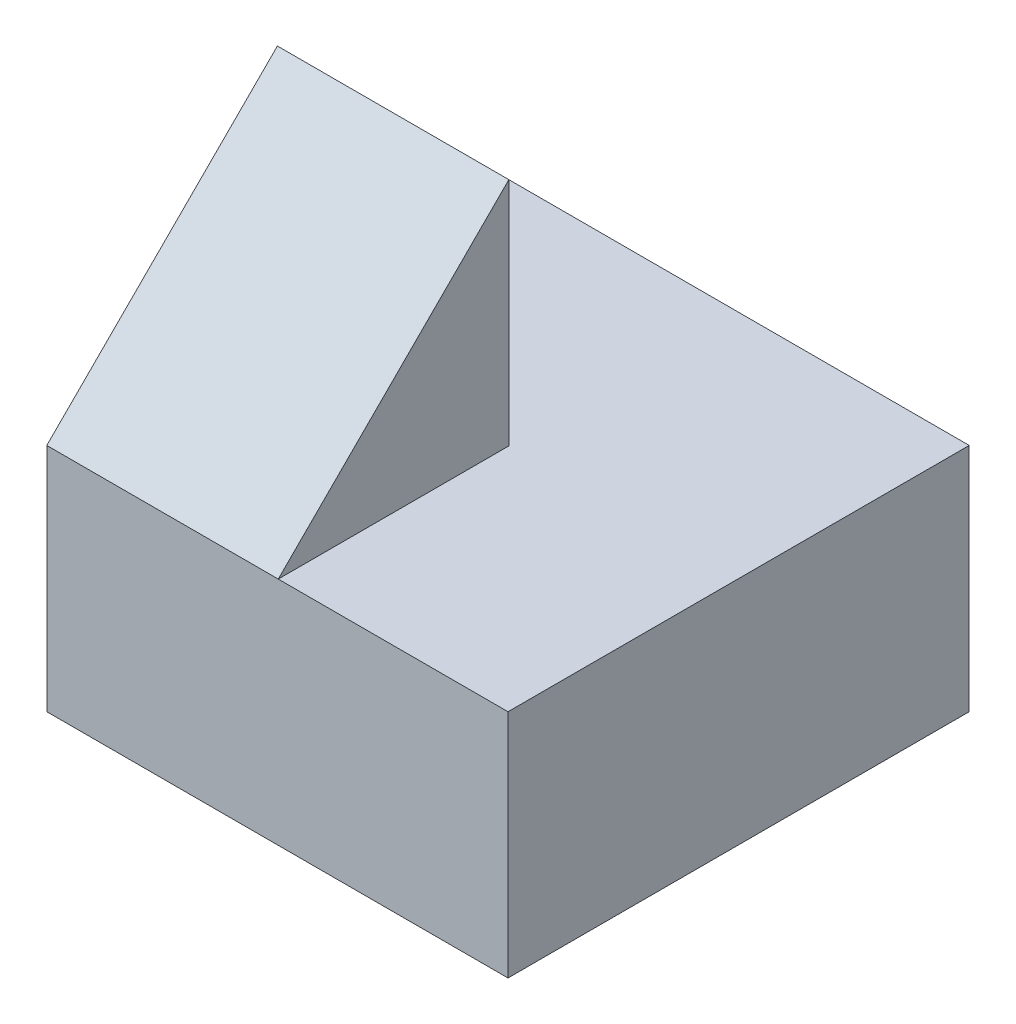
ISO-10303-21;
HEADER;
FILE_DESCRIPTION(('STEP AP214'),'2;1');
FILE_NAME('part.step','',(''),(''),'','','');
FILE_SCHEMA(('AUTOMOTIVE_DESIGN { 1 0 10303 214 1 1 1 1 }'));
ENDSEC;
DATA;
#1=APPLICATION_CONTEXT('core data for automotive mechanical design processes');
#2=APPLICATION_PROTOCOL_DEFINITION('international standard','automotive_design',2000,#1);
#3=PRODUCT_CONTEXT('',#1,'mechanical');
#4=PRODUCT('Part','Part','',(#3));
#5=PRODUCT_RELATED_PRODUCT_CATEGORY('part','',(#4));
#6=PRODUCT_DEFINITION_FORMATION('','',#4);
#7=PRODUCT_DEFINITION_CONTEXT('part definition',#1,'design');
#8=PRODUCT_DEFINITION('design','',#6,#7);
#9=PRODUCT_DEFINITION_SHAPE('','',#8);
#10=(LENGTH_UNIT() NAMED_UNIT(*) SI_UNIT(.MILLI.,.METRE.));
#11=(NAMED_UNIT(*) PLANE_ANGLE_UNIT() SI_UNIT($,.RADIAN.));
#12=(NAMED_UNIT(*) SI_UNIT($,.STERADIAN.) SOLID_ANGLE_UNIT());
#13=UNCERTAINTY_MEASURE_WITH_UNIT(LENGTH_MEASURE(1.E-05),#10,'distance_accuracy_value','');
#14=(GEOMETRIC_REPRESENTATION_CONTEXT(3) GLOBAL_UNCERTAINTY_ASSIGNED_CONTEXT((#13)) GLOBAL_UNIT_ASSIGNED_CONTEXT((#10,
#11,#12)) REPRESENTATION_CONTEXT('',''));
#15=CARTESIAN_POINT('',(0.,0.,0.));
#16=DIRECTION('',(0.,0.,1.));
#17=DIRECTION('',(1.,0.,0.));
#18=AXIS2_PLACEMENT_3D('',#15,#16,#17);
#19=CARTESIAN_POINT('',(4.,4.,0.));
#20=DIRECTION('',(-1.,0.,0.));
#21=DIRECTION('',(0.,0.,1.));
#22=AXIS2_PLACEMENT_3D('',#19,#20,#21);
#23=PLANE('',#22);
#24=DIRECTION('',(0.,0.,-1.));
#25=VECTOR('',#24,1.);
#26=CARTESIAN_POINT('',(4.,2.,0.));
#27=LINE('',#26,#25);
#28=CARTESIAN_POINT('',(4.,2.,0.));
#29=VERTEX_POINT('',#28);
#30=CARTESIAN_POINT('',(4.,2.,-4.));
#31=VERTEX_POINT('',#30);
#32=EDGE_CURVE('E132',#29,#31,#27,.T.);
#33=ORIENTED_EDGE('',*,*,#32,.F.);
#34=DIRECTION('',(0.,-1.,0.));
#35=VECTOR('',#34,1.);
#36=CARTESIAN_POINT('',(4.,4.,0.));
#37=LINE('',#36,#35);
#38=CARTESIAN_POINT('',(4.,0.,0.));
#39=VERTEX_POINT('',#38);
#40=EDGE_CURVE('E42',#29,#39,#37,.T.);
#41=ORIENTED_EDGE('',*,*,#40,.T.);
#42=DIRECTION('',(0.,0.,-1.));
#43=VECTOR('',#42,1.);
#44=CARTESIAN_POINT('',(4.,0.,0.));
#45=LINE('',#44,#43);
#46=CARTESIAN_POINT('',(4.,0.,-4.));
#47=VERTEX_POINT('',#46);
#48=EDGE_CURVE('E122',#39,#47,#45,.T.);
#49=ORIENTED_EDGE('',*,*,#48,.T.);
#50=DIRECTION('',(0.,-1.,0.));
#51=VECTOR('',#50,1.);
#52=CARTESIAN_POINT('',(4.,4.,-4.));
#53=LINE('',#52,#51);
#54=EDGE_CURVE('E56',#31,#47,#53,.T.);
#55=ORIENTED_EDGE('',*,*,#54,.F.);
#56=EDGE_LOOP('',(#33,#41,#49,#55));
#57=FACE_BOUND('',#56,.T.);
#58=ADVANCED_FACE('F34',(#57),#23,.F.);
#59=CARTESIAN_POINT('',(0.,4.,-4.));
#60=DIRECTION('',(0.,0.,1.));
#61=DIRECTION('',(1.,0.,0.));
#62=AXIS2_PLACEMENT_3D('',#59,#60,#61);
#63=PLANE('',#62);
#64=DIRECTION('',(-1.,0.,0.));
#65=VECTOR('',#64,1.);
#66=CARTESIAN_POINT('',(0.,2.,-4.));
#67=LINE('',#66,#65);
#68=CARTESIAN_POINT('',(0.,2.,-4.));
#69=VERTEX_POINT('',#68);
#70=EDGE_CURVE('E141',#31,#69,#67,.T.);
#71=ORIENTED_EDGE('',*,*,#70,.F.);
#72=ORIENTED_EDGE('',*,*,#54,.T.);
#73=DIRECTION('',(-1.,0.,0.));
#74=VECTOR('',#73,1.);
#75=CARTESIAN_POINT('',(0.,0.,-4.));
#76=LINE('',#75,#74);
#77=CARTESIAN_POINT('',(0.,0.,-4.));
#78=VERTEX_POINT('',#77);
#79=EDGE_CURVE('E124',#47,#78,#76,.T.);
#80=ORIENTED_EDGE('',*,*,#79,.T.);
#81=DIRECTION('',(0.,-1.,0.));
#82=VECTOR('',#81,1.);
#83=CARTESIAN_POINT('',(0.,4.,-4.));
#84=LINE('',#83,#82);
#85=EDGE_CURVE('E49',#69,#78,#84,.T.);
#86=ORIENTED_EDGE('',*,*,#85,.F.);
#87=EDGE_LOOP('',(#71,#72,#80,#86));
#88=FACE_BOUND('',#87,.T.);
#89=ADVANCED_FACE('F140',(#88),#63,.F.);
#90=CARTESIAN_POINT('',(0.,4.,0.));
#91=DIRECTION('',(1.,0.,0.));
#92=DIRECTION('',(0.,0.,-1.));
#93=AXIS2_PLACEMENT_3D('',#90,#91,#92);
#94=PLANE('',#93);
#95=DIRECTION('',(0.,-1.,0.));
#96=VECTOR('',#95,1.);
#97=CARTESIAN_POINT('',(0.,4.,0.));
#98=LINE('',#97,#96);
#99=CARTESIAN_POINT('',(0.,2.,0.));
#100=VERTEX_POINT('',#99);
#101=CARTESIAN_POINT('',(0.,0.,0.));
#102=VERTEX_POINT('',#101);
#103=EDGE_CURVE('E12',#100,#102,#98,.T.);
#104=ORIENTED_EDGE('',*,*,#103,.F.);
#105=DIRECTION('',(0.,-0.707106781186548,0.707106781186548));
#106=VECTOR('',#105,1.);
#107=CARTESIAN_POINT('',(0.,1.,1.));
#108=LINE('',#107,#106);
#109=CARTESIAN_POINT('',(0.,4.,-2.));
#110=VERTEX_POINT('',#109);
#111=EDGE_CURVE('E94',#110,#100,#108,.T.);
#112=ORIENTED_EDGE('',*,*,#111,.F.);
#113=DIRECTION('',(0.,1.,0.));
#114=VECTOR('',#113,1.);
#115=CARTESIAN_POINT('',(0.,2.,-2.));
#116=LINE('',#115,#114);
#117=CARTESIAN_POINT('',(0.,2.,-2.));
#118=VERTEX_POINT('',#117);
#119=EDGE_CURVE('E105',#118,#110,#116,.T.);
#120=ORIENTED_EDGE('',*,*,#119,.F.);
#121=DIRECTION('',(0.,0.,1.));
#122=VECTOR('',#121,1.);
#123=CARTESIAN_POINT('',(0.,2.,0.));
#124=LINE('',#123,#122);
#125=EDGE_CURVE('E116',#69,#118,#124,.T.);
#126=ORIENTED_EDGE('',*,*,#125,.F.);
#127=ORIENTED_EDGE('',*,*,#85,.T.);
#128=DIRECTION('',(0.,0.,1.));
#129=VECTOR('',#128,1.);
#130=CARTESIAN_POINT('',(0.,0.,0.));
#131=LINE('',#130,#129);
#132=EDGE_CURVE('E111',#78,#102,#131,.T.);
#133=ORIENTED_EDGE('',*,*,#132,.T.);
#134=EDGE_LOOP('',(#104,#112,#120,#126,#127,#133));
#135=FACE_BOUND('',#134,.T.);
#136=ADVANCED_FACE('F36',(#135),#94,.F.);
#137=CARTESIAN_POINT('',(0.,4.,0.));
#138=DIRECTION('',(0.,0.,-1.));
#139=DIRECTION('',(-1.,0.,0.));
#140=AXIS2_PLACEMENT_3D('',#137,#138,#139);
#141=PLANE('',#140);
#142=DIRECTION('',(1.,0.,0.));
#143=VECTOR('',#142,1.);
#144=CARTESIAN_POINT('',(0.,2.,0.));
#145=LINE('',#144,#143);
#146=CARTESIAN_POINT('',(2.00751210792063,2.,0.));
#147=VERTEX_POINT('',#146);
#148=EDGE_CURVE('E144',#147,#29,#145,.T.);
#149=ORIENTED_EDGE('',*,*,#148,.F.);
#150=DIRECTION('',(-1.,0.,0.));
#151=VECTOR('',#150,1.);
#152=CARTESIAN_POINT('',(10.,2.,0.));
#153=LINE('',#152,#151);
#154=EDGE_CURVE('E106',#147,#100,#153,.T.);
#155=ORIENTED_EDGE('',*,*,#154,.T.);
#156=ORIENTED_EDGE('',*,*,#103,.T.);
#157=DIRECTION('',(1.,0.,0.));
#158=VECTOR('',#157,1.);
#159=CARTESIAN_POINT('',(0.,0.,0.));
#160=LINE('',#159,#158);
#161=EDGE_CURVE('E114',#102,#39,#160,.T.);
#162=ORIENTED_EDGE('',*,*,#161,.T.);
#163=ORIENTED_EDGE('',*,*,#40,.F.);
#164=EDGE_LOOP('',(#149,#155,#156,#162,#163));
#165=FACE_BOUND('',#164,.T.);
#166=ADVANCED_FACE('F136',(#165),#141,.F.);
#167=CARTESIAN_POINT('',(0.,0.,0.));
#168=DIRECTION('',(0.,-1.,0.));
#169=DIRECTION('',(0.,0.,-1.));
#170=AXIS2_PLACEMENT_3D('',#167,#168,#169);
#171=PLANE('',#170);
#172=ORIENTED_EDGE('',*,*,#132,.F.);
#173=ORIENTED_EDGE('',*,*,#79,.F.);
#174=ORIENTED_EDGE('',*,*,#48,.F.);
#175=ORIENTED_EDGE('',*,*,#161,.F.);
#176=EDGE_LOOP('',(#172,#173,#174,#175));
#177=FACE_BOUND('',#176,.T.);
#178=ADVANCED_FACE('F139',(#177),#171,.T.);
#179=CARTESIAN_POINT('',(0.,2.,-2.));
#180=DIRECTION('',(0.,0.,1.));
#181=DIRECTION('',(1.,0.,0.));
#182=AXIS2_PLACEMENT_3D('',#179,#180,#181);
#183=PLANE('',#182);
#184=DIRECTION('',(1.,0.,0.));
#185=VECTOR('',#184,1.);
#186=CARTESIAN_POINT('',(0.,4.,-2.));
#187=LINE('',#186,#185);
#188=CARTESIAN_POINT('',(2.00751210792063,4.,-2.));
#189=VERTEX_POINT('',#188);
#190=EDGE_CURVE('E91',#110,#189,#187,.T.);
#191=ORIENTED_EDGE('',*,*,#190,.T.);
#192=DIRECTION('',(0.,1.,0.));
#193=VECTOR('',#192,1.);
#194=CARTESIAN_POINT('',(2.00751210792063,2.,-2.));
#195=LINE('',#194,#193);
#196=CARTESIAN_POINT('',(2.00751210792063,2.,-2.));
#197=VERTEX_POINT('',#196);
#198=EDGE_CURVE('E112',#197,#189,#195,.T.);
#199=ORIENTED_EDGE('',*,*,#198,.F.);
#200=DIRECTION('',(1.,0.,0.));
#201=VECTOR('',#200,1.);
#202=CARTESIAN_POINT('',(0.,2.,-2.));
#203=LINE('',#202,#201);
#204=EDGE_CURVE('E101',#118,#197,#203,.T.);
#205=ORIENTED_EDGE('',*,*,#204,.F.);
#206=ORIENTED_EDGE('',*,*,#119,.T.);
#207=EDGE_LOOP('',(#191,#199,#205,#206));
#208=FACE_BOUND('',#207,.T.);
#209=ADVANCED_FACE('F108',(#208),#183,.F.);
#210=CARTESIAN_POINT('',(2.00751210792063,2.,0.));
#211=DIRECTION('',(-1.,0.,0.));
#212=DIRECTION('',(0.,0.,1.));
#213=AXIS2_PLACEMENT_3D('',#210,#211,#212);
#214=PLANE('',#213);
#215=ORIENTED_EDGE('',*,*,#198,.T.);
#216=DIRECTION('',(0.,-0.707106781186548,0.707106781186548));
#217=VECTOR('',#216,1.);
#218=CARTESIAN_POINT('',(2.00751210792063,2.,0.));
#219=LINE('',#218,#217);
#220=EDGE_CURVE('E97',#189,#147,#219,.T.);
#221=ORIENTED_EDGE('',*,*,#220,.T.);
#222=DIRECTION('',(0.,0.,1.));
#223=VECTOR('',#222,1.);
#224=CARTESIAN_POINT('',(2.00751210792063,2.,0.));
#225=LINE('',#224,#223);
#226=EDGE_CURVE('E148',#197,#147,#225,.T.);
#227=ORIENTED_EDGE('',*,*,#226,.F.);
#228=EDGE_LOOP('',(#215,#221,#227));
#229=FACE_BOUND('',#228,.T.);
#230=ADVANCED_FACE('F155',(#229),#214,.F.);
#231=CARTESIAN_POINT('',(0.,2.,0.));
#232=DIRECTION('',(0.,1.,0.));
#233=DIRECTION('',(0.,0.,1.));
#234=AXIS2_PLACEMENT_3D('',#231,#232,#233);
#235=PLANE('',#234);
#236=ORIENTED_EDGE('',*,*,#204,.T.);
#237=ORIENTED_EDGE('',*,*,#226,.T.);
#238=ORIENTED_EDGE('',*,*,#148,.T.);
#239=ORIENTED_EDGE('',*,*,#32,.T.);
#240=ORIENTED_EDGE('',*,*,#70,.T.);
#241=ORIENTED_EDGE('',*,*,#125,.T.);
#242=EDGE_LOOP('',(#236,#237,#238,#239,#240,#241));
#243=FACE_BOUND('',#242,.T.);
#244=ADVANCED_FACE('F156',(#243),#235,.T.);
#245=CARTESIAN_POINT('',(10.,1.,1.));
#246=DIRECTION('',(0.,-0.707106781186548,-0.707106781186548));
#247=DIRECTION('',(0.,0.707106781186548,-0.707106781186548));
#248=AXIS2_PLACEMENT_3D('',#245,#246,#247);
#249=PLANE('',#248);
#250=ORIENTED_EDGE('',*,*,#190,.F.);
#251=ORIENTED_EDGE('',*,*,#111,.T.);
#252=ORIENTED_EDGE('',*,*,#154,.F.);
#253=ORIENTED_EDGE('',*,*,#220,.F.);
#254=EDGE_LOOP('',(#250,#251,#252,#253));
#255=FACE_BOUND('',#254,.T.);
#256=ADVANCED_FACE('F93',(#255),#249,.F.);
#257=CLOSED_SHELL('',(#58,#89,#136,#166,#178,#209,#230,#244,#256));
#258=MANIFOLD_SOLID_BREP('B2',#257);
#259=ADVANCED_BREP_SHAPE_REPRESENTATION('',(#18,#258),#14);
#260=SHAPE_DEFINITION_REPRESENTATION(#9,#259);
ENDSEC;
END-ISO-10303-21;
